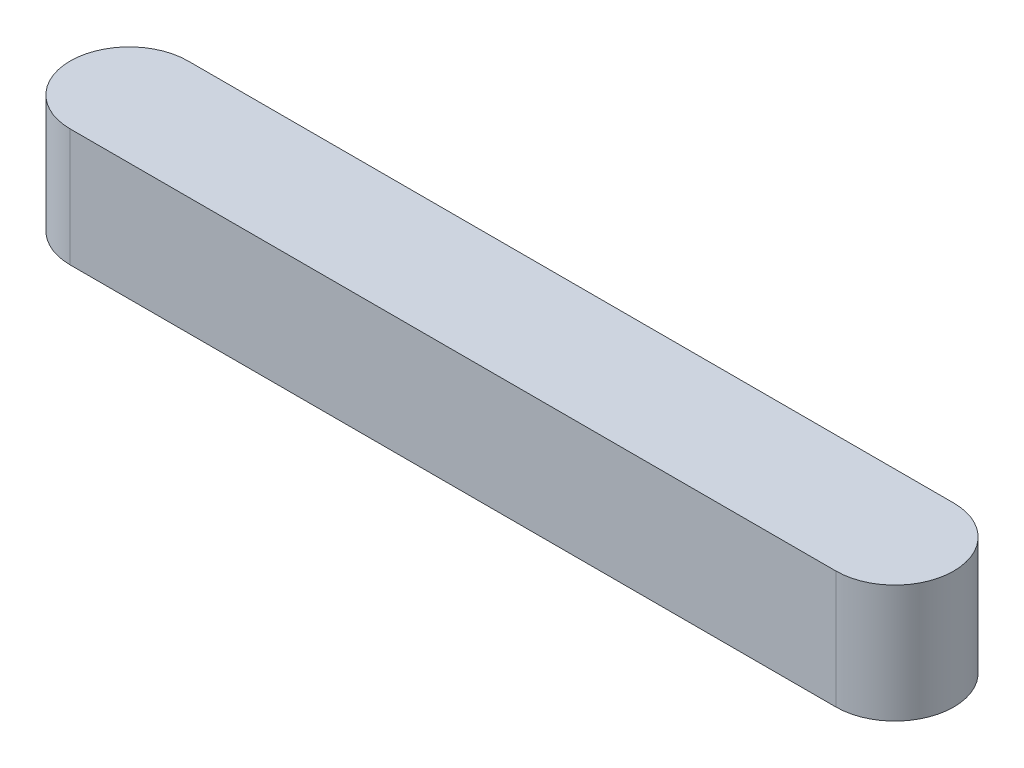
ISO-10303-21;
HEADER;
FILE_DESCRIPTION(('STEP AP214'),'2;1');
FILE_NAME('part.step','',(''),(''),'','','');
FILE_SCHEMA(('AUTOMOTIVE_DESIGN { 1 0 10303 214 1 1 1 1 }'));
ENDSEC;
DATA;
#1=APPLICATION_CONTEXT('core data for automotive mechanical design processes');
#2=APPLICATION_PROTOCOL_DEFINITION('international standard','automotive_design',2000,#1);
#3=PRODUCT_CONTEXT('',#1,'mechanical');
#4=PRODUCT('Part','Part','',(#3));
#5=PRODUCT_RELATED_PRODUCT_CATEGORY('part','',(#4));
#6=PRODUCT_DEFINITION_FORMATION('','',#4);
#7=PRODUCT_DEFINITION_CONTEXT('part definition',#1,'design');
#8=PRODUCT_DEFINITION('design','',#6,#7);
#9=PRODUCT_DEFINITION_SHAPE('','',#8);
#10=(LENGTH_UNIT() NAMED_UNIT(*) SI_UNIT(.MILLI.,.METRE.));
#11=(NAMED_UNIT(*) PLANE_ANGLE_UNIT() SI_UNIT($,.RADIAN.));
#12=(NAMED_UNIT(*) SI_UNIT($,.STERADIAN.) SOLID_ANGLE_UNIT());
#13=UNCERTAINTY_MEASURE_WITH_UNIT(LENGTH_MEASURE(1.E-05),#10,'distance_accuracy_value','');
#14=(GEOMETRIC_REPRESENTATION_CONTEXT(3) GLOBAL_UNCERTAINTY_ASSIGNED_CONTEXT((#13)) GLOBAL_UNIT_ASSIGNED_CONTEXT((#10,
#11,#12)) REPRESENTATION_CONTEXT('',''));
#15=CARTESIAN_POINT('',(0.,0.,0.));
#16=DIRECTION('',(0.,0.,1.));
#17=DIRECTION('',(1.,0.,0.));
#18=AXIS2_PLACEMENT_3D('',#15,#16,#17);
#19=CARTESIAN_POINT('',(15.,4.,-2.));
#20=DIRECTION('',(0.,1.,0.));
#21=DIRECTION('',(0.,0.,1.));
#22=AXIS2_PLACEMENT_3D('',#19,#20,#21);
#23=PLANE('',#22);
#24=CARTESIAN_POINT('',(28.,4.,-2.));
#25=DIRECTION('',(0.,1.,0.));
#26=DIRECTION('',(0.,0.,1.));
#27=AXIS2_PLACEMENT_3D('',#24,#25,#26);
#28=CIRCLE('',#27,2.);
#29=CARTESIAN_POINT('',(28.,4.,-4.));
#30=VERTEX_POINT('',#29);
#31=CARTESIAN_POINT('',(28.,4.,0.));
#32=VERTEX_POINT('',#31);
#33=EDGE_CURVE('E20',#30,#32,#28,.F.);
#34=ORIENTED_EDGE('',*,*,#33,.F.);
#35=DIRECTION('',(-1.,0.,0.));
#36=VECTOR('',#35,1.);
#37=CARTESIAN_POINT('',(30.,4.,-4.));
#38=LINE('',#37,#36);
#39=CARTESIAN_POINT('',(2.,4.,-4.));
#40=VERTEX_POINT('',#39);
#41=EDGE_CURVE('E75',#40,#30,#38,.F.);
#42=ORIENTED_EDGE('',*,*,#41,.F.);
#43=CARTESIAN_POINT('',(2.,4.,-2.));
#44=DIRECTION('',(0.,1.,0.));
#45=DIRECTION('',(0.,0.,1.));
#46=AXIS2_PLACEMENT_3D('',#43,#44,#45);
#47=CIRCLE('',#46,2.);
#48=CARTESIAN_POINT('',(2.,4.,0.));
#49=VERTEX_POINT('',#48);
#50=EDGE_CURVE('E66',#49,#40,#47,.F.);
#51=ORIENTED_EDGE('',*,*,#50,.F.);
#52=DIRECTION('',(1.,0.,0.));
#53=VECTOR('',#52,1.);
#54=CARTESIAN_POINT('',(0.,4.,0.));
#55=LINE('',#54,#53);
#56=EDGE_CURVE('E64',#32,#49,#55,.F.);
#57=ORIENTED_EDGE('',*,*,#56,.F.);
#58=EDGE_LOOP('',(#34,#42,#51,#57));
#59=FACE_BOUND('',#58,.T.);
#60=ADVANCED_FACE('F17',(#59),#23,.T.);
#61=CARTESIAN_POINT('',(0.,0.,0.));
#62=DIRECTION('',(0.,0.,1.));
#63=DIRECTION('',(1.,0.,0.));
#64=AXIS2_PLACEMENT_3D('',#61,#62,#63);
#65=PLANE('',#64);
#66=DIRECTION('',(0.,1.,0.));
#67=VECTOR('',#66,1.);
#68=CARTESIAN_POINT('',(28.,0.,0.));
#69=LINE('',#68,#67);
#70=CARTESIAN_POINT('',(28.,0.,0.));
#71=VERTEX_POINT('',#70);
#72=EDGE_CURVE('E61',#32,#71,#69,.F.);
#73=ORIENTED_EDGE('',*,*,#72,.F.);
#74=ORIENTED_EDGE('',*,*,#56,.T.);
#75=DIRECTION('',(0.,1.,0.));
#76=VECTOR('',#75,1.);
#77=CARTESIAN_POINT('',(2.,0.,0.));
#78=LINE('',#77,#76);
#79=CARTESIAN_POINT('',(2.,0.,0.));
#80=VERTEX_POINT('',#79);
#81=EDGE_CURVE('E81',#80,#49,#78,.T.);
#82=ORIENTED_EDGE('',*,*,#81,.F.);
#83=DIRECTION('',(1.,0.,0.));
#84=VECTOR('',#83,1.);
#85=CARTESIAN_POINT('',(15.,0.,0.));
#86=LINE('',#85,#84);
#87=EDGE_CURVE('E73',#80,#71,#86,.T.);
#88=ORIENTED_EDGE('',*,*,#87,.T.);
#89=EDGE_LOOP('',(#73,#74,#82,#88));
#90=FACE_BOUND('',#89,.T.);
#91=ADVANCED_FACE('F72',(#90),#65,.T.);
#92=CARTESIAN_POINT('',(28.,0.,-2.));
#93=DIRECTION('',(0.,1.,0.));
#94=DIRECTION('',(0.,0.,1.));
#95=AXIS2_PLACEMENT_3D('',#92,#93,#94);
#96=CYLINDRICAL_SURFACE('',#95,2.);
#97=CARTESIAN_POINT('',(28.,0.,-2.));
#98=DIRECTION('',(0.,1.,0.));
#99=DIRECTION('',(0.,0.,1.));
#100=AXIS2_PLACEMENT_3D('',#97,#98,#99);
#101=CIRCLE('',#100,2.);
#102=CARTESIAN_POINT('',(28.,0.,-4.));
#103=VERTEX_POINT('',#102);
#104=EDGE_CURVE('E80',#71,#103,#101,.T.);
#105=ORIENTED_EDGE('',*,*,#104,.T.);
#106=DIRECTION('',(0.,1.,0.));
#107=VECTOR('',#106,1.);
#108=CARTESIAN_POINT('',(28.,0.,-4.));
#109=LINE('',#108,#107);
#110=EDGE_CURVE('E63',#30,#103,#109,.F.);
#111=ORIENTED_EDGE('',*,*,#110,.F.);
#112=ORIENTED_EDGE('',*,*,#33,.T.);
#113=ORIENTED_EDGE('',*,*,#72,.T.);
#114=EDGE_LOOP('',(#105,#111,#112,#113));
#115=FACE_BOUND('',#114,.T.);
#116=ADVANCED_FACE('F59',(#115),#96,.T.);
#117=CARTESIAN_POINT('',(30.,0.,-4.));
#118=DIRECTION('',(0.,0.,-1.));
#119=DIRECTION('',(-1.,0.,0.));
#120=AXIS2_PLACEMENT_3D('',#117,#118,#119);
#121=PLANE('',#120);
#122=DIRECTION('',(0.,1.,0.));
#123=VECTOR('',#122,1.);
#124=CARTESIAN_POINT('',(2.,0.,-4.));
#125=LINE('',#124,#123);
#126=CARTESIAN_POINT('',(2.,0.,-4.));
#127=VERTEX_POINT('',#126);
#128=EDGE_CURVE('E34',#40,#127,#125,.F.);
#129=ORIENTED_EDGE('',*,*,#128,.F.);
#130=ORIENTED_EDGE('',*,*,#41,.T.);
#131=ORIENTED_EDGE('',*,*,#110,.T.);
#132=DIRECTION('',(1.,0.,0.));
#133=VECTOR('',#132,1.);
#134=CARTESIAN_POINT('',(15.,0.,-4.));
#135=LINE('',#134,#133);
#136=EDGE_CURVE('E26',#103,#127,#135,.F.);
#137=ORIENTED_EDGE('',*,*,#136,.T.);
#138=EDGE_LOOP('',(#129,#130,#131,#137));
#139=FACE_BOUND('',#138,.T.);
#140=ADVANCED_FACE('F88',(#139),#121,.T.);
#141=CARTESIAN_POINT('',(2.,0.,-2.));
#142=DIRECTION('',(0.,1.,0.));
#143=DIRECTION('',(0.,0.,1.));
#144=AXIS2_PLACEMENT_3D('',#141,#142,#143);
#145=CYLINDRICAL_SURFACE('',#144,2.);
#146=CARTESIAN_POINT('',(2.,0.,-2.));
#147=DIRECTION('',(0.,1.,0.));
#148=DIRECTION('',(0.,0.,1.));
#149=AXIS2_PLACEMENT_3D('',#146,#147,#148);
#150=CIRCLE('',#149,2.);
#151=EDGE_CURVE('E11',#127,#80,#150,.T.);
#152=ORIENTED_EDGE('',*,*,#151,.T.);
#153=ORIENTED_EDGE('',*,*,#81,.T.);
#154=ORIENTED_EDGE('',*,*,#50,.T.);
#155=ORIENTED_EDGE('',*,*,#128,.T.);
#156=EDGE_LOOP('',(#152,#153,#154,#155));
#157=FACE_BOUND('',#156,.T.);
#158=ADVANCED_FACE('F91',(#157),#145,.T.);
#159=CARTESIAN_POINT('',(15.,0.,-2.));
#160=DIRECTION('',(0.,1.,0.));
#161=DIRECTION('',(0.,0.,1.));
#162=AXIS2_PLACEMENT_3D('',#159,#160,#161);
#163=PLANE('',#162);
#164=ORIENTED_EDGE('',*,*,#136,.F.);
#165=ORIENTED_EDGE('',*,*,#104,.F.);
#166=ORIENTED_EDGE('',*,*,#87,.F.);
#167=ORIENTED_EDGE('',*,*,#151,.F.);
#168=EDGE_LOOP('',(#164,#165,#166,#167));
#169=FACE_BOUND('',#168,.T.);
#170=ADVANCED_FACE('F90',(#169),#163,.F.);
#171=CLOSED_SHELL('',(#60,#91,#116,#140,#158,#170));
#172=MANIFOLD_SOLID_BREP('B1',#171);
#173=ADVANCED_BREP_SHAPE_REPRESENTATION('',(#18,#172),#14);
#174=SHAPE_DEFINITION_REPRESENTATION(#9,#173);
ENDSEC;
END-ISO-10303-21;
